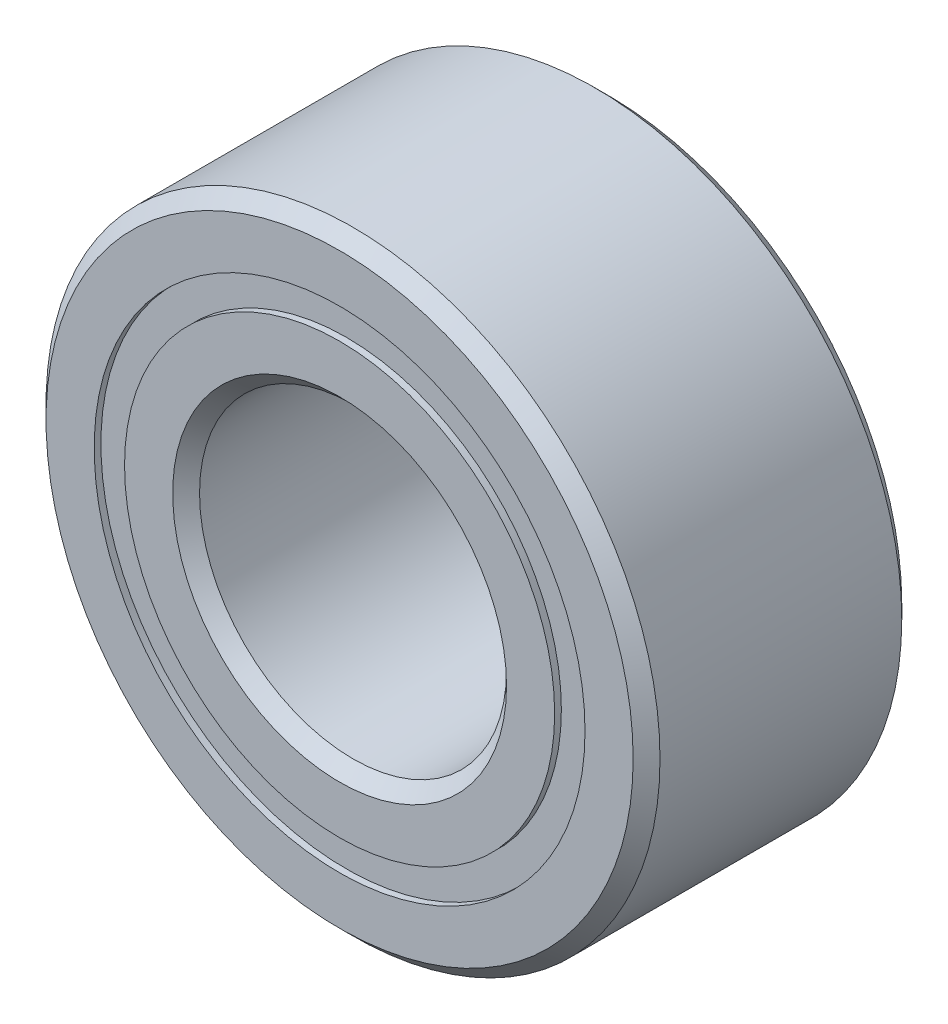
ISO-10303-21;
HEADER;
FILE_DESCRIPTION(('STEP AP214'),'2;1');
FILE_NAME('part.step','',(''),(''),'','','');
FILE_SCHEMA(('AUTOMOTIVE_DESIGN { 1 0 10303 214 1 1 1 1 }'));
ENDSEC;
DATA;
#1=APPLICATION_CONTEXT('core data for automotive mechanical design processes');
#2=APPLICATION_PROTOCOL_DEFINITION('international standard','automotive_design',2000,#1);
#3=PRODUCT_CONTEXT('',#1,'mechanical');
#4=PRODUCT('Part','Part','',(#3));
#5=PRODUCT_RELATED_PRODUCT_CATEGORY('part','',(#4));
#6=PRODUCT_DEFINITION_FORMATION('','',#4);
#7=PRODUCT_DEFINITION_CONTEXT('part definition',#1,'design');
#8=PRODUCT_DEFINITION('design','',#6,#7);
#9=PRODUCT_DEFINITION_SHAPE('','',#8);
#10=(LENGTH_UNIT() NAMED_UNIT(*) SI_UNIT(.MILLI.,.METRE.));
#11=(NAMED_UNIT(*) PLANE_ANGLE_UNIT() SI_UNIT($,.RADIAN.));
#12=(NAMED_UNIT(*) SI_UNIT($,.STERADIAN.) SOLID_ANGLE_UNIT());
#13=UNCERTAINTY_MEASURE_WITH_UNIT(LENGTH_MEASURE(1.E-05),#10,'distance_accuracy_value','');
#14=(GEOMETRIC_REPRESENTATION_CONTEXT(3) GLOBAL_UNCERTAINTY_ASSIGNED_CONTEXT((#13)) GLOBAL_UNIT_ASSIGNED_CONTEXT((#10,
#11,#12)) REPRESENTATION_CONTEXT('',''));
#15=CARTESIAN_POINT('',(0.,0.,0.));
#16=DIRECTION('',(0.,0.,1.));
#17=DIRECTION('',(1.,0.,0.));
#18=AXIS2_PLACEMENT_3D('',#15,#16,#17);
#19=CARTESIAN_POINT('',(0.,2.53825549450549,-1.319609375));
#20=DIRECTION('',(0.,0.,1.));
#21=DIRECTION('',(1.,0.,0.));
#22=AXIS2_PLACEMENT_3D('',#19,#20,#21);
#23=PLANE('',#22);
#24=CARTESIAN_POINT('',(0.,0.,-1.319609375));
#25=DIRECTION('',(0.,0.,1.));
#26=DIRECTION('',(1.,0.,0.));
#27=AXIS2_PLACEMENT_3D('',#24,#25,#26);
#28=CIRCLE('',#27,2.53825549450549);
#29=CARTESIAN_POINT('',(2.53825549450549,0.,-1.319609375));
#30=VERTEX_POINT('',#29);
#31=EDGE_CURVE('E60',#30,#30,#28,.T.);
#32=ORIENTED_EDGE('',*,*,#31,.F.);
#33=EDGE_LOOP('',(#32));
#34=FACE_BOUND('',#33,.T.);
#35=CARTESIAN_POINT('',(0.,0.,-1.319609375));
#36=DIRECTION('',(0.,0.,1.));
#37=DIRECTION('',(1.,0.,0.));
#38=AXIS2_PLACEMENT_3D('',#35,#36,#37);
#39=CIRCLE('',#38,2.22424450549451);
#40=CARTESIAN_POINT('',(2.22424450549451,0.,-1.319609375));
#41=VERTEX_POINT('',#40);
#42=EDGE_CURVE('E11',#41,#41,#39,.T.);
#43=ORIENTED_EDGE('',*,*,#42,.T.);
#44=EDGE_LOOP('',(#43));
#45=FACE_BOUND('',#44,.T.);
#46=ADVANCED_FACE('F46',(#34,#45),#23,.F.);
#47=CARTESIAN_POINT('',(0.,0.,1.3890625));
#48=DIRECTION('',(0.,0.,1.));
#49=DIRECTION('',(1.,0.,0.));
#50=AXIS2_PLACEMENT_3D('',#47,#48,#49);
#51=CYLINDRICAL_SURFACE('',#50,2.22424450549451);
#52=ORIENTED_EDGE('',*,*,#42,.F.);
#53=EDGE_LOOP('',(#52));
#54=FACE_BOUND('',#53,.T.);
#55=CARTESIAN_POINT('',(0.,0.,-0.637012925157144));
#56=DIRECTION('',(0.,0.,1.));
#57=DIRECTION('',(1.,0.,0.));
#58=AXIS2_PLACEMENT_3D('',#55,#56,#57);
#59=CIRCLE('',#58,2.22424450549451);
#60=CARTESIAN_POINT('',(2.22424450549451,0.,-0.637012925157144));
#61=VERTEX_POINT('',#60);
#62=EDGE_CURVE('E52',#61,#61,#59,.T.);
#63=ORIENTED_EDGE('',*,*,#62,.T.);
#64=EDGE_LOOP('',(#63));
#65=FACE_BOUND('',#64,.T.);
#66=ADVANCED_FACE('F69',(#54,#65),#51,.F.);
#67=CARTESIAN_POINT('',(0.,2.53825549450549,-0.637012925157144));
#68=DIRECTION('',(0.,0.,-1.));
#69=DIRECTION('',(-1.,0.,0.));
#70=AXIS2_PLACEMENT_3D('',#67,#68,#69);
#71=PLANE('',#70);
#72=ORIENTED_EDGE('',*,*,#62,.F.);
#73=EDGE_LOOP('',(#72));
#74=FACE_BOUND('',#73,.T.);
#75=CARTESIAN_POINT('',(0.,0.,-0.637012925157144));
#76=DIRECTION('',(0.,0.,1.));
#77=DIRECTION('',(1.,0.,0.));
#78=AXIS2_PLACEMENT_3D('',#75,#76,#77);
#79=CIRCLE('',#78,2.53825549450549);
#80=CARTESIAN_POINT('',(2.53825549450549,0.,-0.637012925157144));
#81=VERTEX_POINT('',#80);
#82=EDGE_CURVE('E56',#81,#81,#79,.T.);
#83=ORIENTED_EDGE('',*,*,#82,.T.);
#84=EDGE_LOOP('',(#83));
#85=FACE_BOUND('',#84,.T.);
#86=ADVANCED_FACE('F73',(#74,#85),#71,.F.);
#87=CARTESIAN_POINT('',(0.,0.,1.3890625));
#88=DIRECTION('',(0.,0.,1.));
#89=DIRECTION('',(1.,0.,0.));
#90=AXIS2_PLACEMENT_3D('',#87,#88,#89);
#91=CYLINDRICAL_SURFACE('',#90,2.53825549450549);
#92=ORIENTED_EDGE('',*,*,#82,.F.);
#93=EDGE_LOOP('',(#92));
#94=FACE_BOUND('',#93,.T.);
#95=ORIENTED_EDGE('',*,*,#31,.T.);
#96=EDGE_LOOP('',(#95));
#97=FACE_BOUND('',#96,.T.);
#98=ADVANCED_FACE('F66',(#94,#97),#91,.T.);
#99=CLOSED_SHELL('',(#46,#66,#86,#98));
#100=MANIFOLD_SOLID_BREP('B2',#99);
#101=CARTESIAN_POINT('',(0.,2.53825549450549,1.319609375));
#102=DIRECTION('',(0.,0.,-1.));
#103=DIRECTION('',(-1.,0.,0.));
#104=AXIS2_PLACEMENT_3D('',#101,#102,#103);
#105=PLANE('',#104);
#106=CARTESIAN_POINT('',(0.,0.,1.319609375));
#107=DIRECTION('',(0.,0.,1.));
#108=DIRECTION('',(1.,0.,0.));
#109=AXIS2_PLACEMENT_3D('',#106,#107,#108);
#110=CIRCLE('',#109,2.2242445054945);
#111=CARTESIAN_POINT('',(2.2242445054945,0.,1.319609375));
#112=VERTEX_POINT('',#111);
#113=EDGE_CURVE('E45',#112,#112,#110,.T.);
#114=ORIENTED_EDGE('',*,*,#113,.F.);
#115=EDGE_LOOP('',(#114));
#116=FACE_BOUND('',#115,.T.);
#117=CARTESIAN_POINT('',(0.,0.,1.319609375));
#118=DIRECTION('',(0.,0.,1.));
#119=DIRECTION('',(1.,0.,0.));
#120=AXIS2_PLACEMENT_3D('',#117,#118,#119);
#121=CIRCLE('',#120,2.53825549450549);
#122=CARTESIAN_POINT('',(2.53825549450549,0.,1.319609375));
#123=VERTEX_POINT('',#122);
#124=EDGE_CURVE('E128',#123,#123,#121,.T.);
#125=ORIENTED_EDGE('',*,*,#124,.T.);
#126=EDGE_LOOP('',(#125));
#127=FACE_BOUND('',#126,.T.);
#128=ADVANCED_FACE('F114',(#116,#127),#105,.F.);
#129=CARTESIAN_POINT('',(0.,0.,1.3890625));
#130=DIRECTION('',(0.,0.,1.));
#131=DIRECTION('',(1.,0.,0.));
#132=AXIS2_PLACEMENT_3D('',#129,#130,#131);
#133=CYLINDRICAL_SURFACE('',#132,2.2242445054945);
#134=CARTESIAN_POINT('',(0.,0.,0.637012925157143));
#135=DIRECTION('',(0.,0.,1.));
#136=DIRECTION('',(1.,0.,0.));
#137=AXIS2_PLACEMENT_3D('',#134,#135,#136);
#138=CIRCLE('',#137,2.2242445054945);
#139=CARTESIAN_POINT('',(2.2242445054945,0.,0.637012925157143));
#140=VERTEX_POINT('',#139);
#141=EDGE_CURVE('E120',#140,#140,#138,.T.);
#142=ORIENTED_EDGE('',*,*,#141,.F.);
#143=EDGE_LOOP('',(#142));
#144=FACE_BOUND('',#143,.T.);
#145=ORIENTED_EDGE('',*,*,#113,.T.);
#146=EDGE_LOOP('',(#145));
#147=FACE_BOUND('',#146,.T.);
#148=ADVANCED_FACE('F143',(#144,#147),#133,.F.);
#149=CARTESIAN_POINT('',(0.,2.53825549450549,0.637012925157143));
#150=DIRECTION('',(0.,0.,1.));
#151=DIRECTION('',(1.,0.,0.));
#152=AXIS2_PLACEMENT_3D('',#149,#150,#151);
#153=PLANE('',#152);
#154=CARTESIAN_POINT('',(0.,0.,0.637012925157143));
#155=DIRECTION('',(0.,0.,1.));
#156=DIRECTION('',(1.,0.,0.));
#157=AXIS2_PLACEMENT_3D('',#154,#155,#156);
#158=CIRCLE('',#157,2.53825549450549);
#159=CARTESIAN_POINT('',(2.53825549450549,0.,0.637012925157143));
#160=VERTEX_POINT('',#159);
#161=EDGE_CURVE('E124',#160,#160,#158,.T.);
#162=ORIENTED_EDGE('',*,*,#161,.F.);
#163=EDGE_LOOP('',(#162));
#164=FACE_BOUND('',#163,.T.);
#165=ORIENTED_EDGE('',*,*,#141,.T.);
#166=EDGE_LOOP('',(#165));
#167=FACE_BOUND('',#166,.T.);
#168=ADVANCED_FACE('F138',(#164,#167),#153,.F.);
#169=CARTESIAN_POINT('',(0.,0.,1.3890625));
#170=DIRECTION('',(0.,0.,1.));
#171=DIRECTION('',(1.,0.,0.));
#172=AXIS2_PLACEMENT_3D('',#169,#170,#171);
#173=CYLINDRICAL_SURFACE('',#172,2.53825549450549);
#174=ORIENTED_EDGE('',*,*,#124,.F.);
#175=EDGE_LOOP('',(#174));
#176=FACE_BOUND('',#175,.T.);
#177=ORIENTED_EDGE('',*,*,#161,.T.);
#178=EDGE_LOOP('',(#177));
#179=FACE_BOUND('',#178,.T.);
#180=ADVANCED_FACE('F135',(#176,#179),#173,.T.);
#181=CLOSED_SHELL('',(#128,#148,#168,#180));
#182=MANIFOLD_SOLID_BREP('B6',#181);
#183=CARTESIAN_POINT('',(-1.39966363202143,1.92647171785536,0.));
#184=DIRECTION('',(0.,0.,1.));
#185=DIRECTION('',(-0.587785252292462,0.809016994374955,0.));
#186=AXIS2_PLACEMENT_3D('',#183,#184,#185);
#187=SPHERICAL_SURFACE('',#186,0.637012925157143);
#188=CARTESIAN_POINT('',(-1.39966363202143,1.92647171785536,0.637012925157143));
#189=VERTEX_POINT('',#188);
#190=VERTEX_LOOP('',#189);
#191=FACE_BOUND('',#190,.T.);
#192=ADVANCED_FACE('F182',(#191),#187,.T.);
#193=CLOSED_SHELL('',(#192));
#194=MANIFOLD_SOLID_BREP('B40',#193);
#195=CARTESIAN_POINT('',(-2.26470332942783,0.735846717855369,0.));
#196=DIRECTION('',(0.,0.,1.));
#197=DIRECTION('',(-0.95105651629515,0.309016994374958,0.));
#198=AXIS2_PLACEMENT_3D('',#195,#196,#197);
#199=SPHERICAL_SURFACE('',#198,0.637012925157143);
#200=CARTESIAN_POINT('',(-2.26470332942783,0.735846717855369,0.637012925157143));
#201=VERTEX_POINT('',#200);
#202=VERTEX_LOOP('',#201);
#203=FACE_BOUND('',#202,.T.);
#204=ADVANCED_FACE('F203',(#203),#199,.T.);
#205=CLOSED_SHELL('',(#204));
#206=MANIFOLD_SOLID_BREP('B110',#205);
#207=CARTESIAN_POINT('',(-2.26470332942784,-0.735846717855322,0.));
#208=DIRECTION('',(0.,0.,1.));
#209=DIRECTION('',(-0.951056516295157,-0.309016994374938,0.));
#210=AXIS2_PLACEMENT_3D('',#207,#208,#209);
#211=SPHERICAL_SURFACE('',#210,0.637012925157143);
#212=CARTESIAN_POINT('',(-2.26470332942784,-0.735846717855322,0.637012925157143));
#213=VERTEX_POINT('',#212);
#214=VERTEX_LOOP('',#213);
#215=FACE_BOUND('',#214,.T.);
#216=ADVANCED_FACE('F224',(#215),#211,.T.);
#217=CLOSED_SHELL('',(#216));
#218=MANIFOLD_SOLID_BREP('B178',#217);
#219=CARTESIAN_POINT('',(-1.39966363202147,-1.92647171785533,0.));
#220=DIRECTION('',(0.,0.,1.));
#221=DIRECTION('',(-0.58778525229248,-0.809016994374942,0.));
#222=AXIS2_PLACEMENT_3D('',#219,#220,#221);
#223=SPHERICAL_SURFACE('',#222,0.637012925157143);
#224=CARTESIAN_POINT('',(-1.39966363202147,-1.92647171785533,0.637012925157143));
#225=VERTEX_POINT('',#224);
#226=VERTEX_LOOP('',#225);
#227=FACE_BOUND('',#226,.T.);
#228=ADVANCED_FACE('F245',(#227),#223,.T.);
#229=CLOSED_SHELL('',(#228));
#230=MANIFOLD_SOLID_BREP('B199',#229);
#231=CARTESIAN_POINT('',(0.,-2.38125,0.));
#232=DIRECTION('',(0.,0.,1.));
#233=DIRECTION('',(0.,-1.,0.));
#234=AXIS2_PLACEMENT_3D('',#231,#232,#233);
#235=SPHERICAL_SURFACE('',#234,0.637012925157143);
#236=CARTESIAN_POINT('',(0.,-2.38125,0.637012925157143));
#237=VERTEX_POINT('',#236);
#238=VERTEX_LOOP('',#237);
#239=FACE_BOUND('',#238,.T.);
#240=ADVANCED_FACE('F266',(#239),#235,.T.);
#241=CLOSED_SHELL('',(#240));
#242=MANIFOLD_SOLID_BREP('B220',#241);
#243=CARTESIAN_POINT('',(1.39966363202144,-1.92647171785535,0.));
#244=DIRECTION('',(0.,0.,1.));
#245=DIRECTION('',(0.587785252292469,-0.809016994374951,0.));
#246=AXIS2_PLACEMENT_3D('',#243,#244,#245);
#247=SPHERICAL_SURFACE('',#246,0.637012925157143);
#248=CARTESIAN_POINT('',(1.39966363202144,-1.92647171785535,0.637012925157143));
#249=VERTEX_POINT('',#248);
#250=VERTEX_LOOP('',#249);
#251=FACE_BOUND('',#250,.T.);
#252=ADVANCED_FACE('F287',(#251),#247,.T.);
#253=CLOSED_SHELL('',(#252));
#254=MANIFOLD_SOLID_BREP('B241',#253);
#255=CARTESIAN_POINT('',(2.26470332942783,-0.735846717855353,0.));
#256=DIRECTION('',(0.,0.,1.));
#257=DIRECTION('',(0.951056516295152,-0.309016994374952,0.));
#258=AXIS2_PLACEMENT_3D('',#255,#256,#257);
#259=SPHERICAL_SURFACE('',#258,0.637012925157143);
#260=CARTESIAN_POINT('',(2.26470332942783,-0.735846717855353,0.637012925157143));
#261=VERTEX_POINT('',#260);
#262=VERTEX_LOOP('',#261);
#263=FACE_BOUND('',#262,.T.);
#264=ADVANCED_FACE('F308',(#263),#259,.T.);
#265=CLOSED_SHELL('',(#264));
#266=MANIFOLD_SOLID_BREP('B262',#265);
#267=CARTESIAN_POINT('',(2.26470332942784,0.735846717855337,0.));
#268=DIRECTION('',(0.,0.,1.));
#269=DIRECTION('',(0.951056516295155,0.309016994374945,0.));
#270=AXIS2_PLACEMENT_3D('',#267,#268,#269);
#271=SPHERICAL_SURFACE('',#270,0.637012925157143);
#272=CARTESIAN_POINT('',(2.26470332942784,0.735846717855337,0.637012925157143));
#273=VERTEX_POINT('',#272);
#274=VERTEX_LOOP('',#273);
#275=FACE_BOUND('',#274,.T.);
#276=ADVANCED_FACE('F329',(#275),#271,.T.);
#277=CLOSED_SHELL('',(#276));
#278=MANIFOLD_SOLID_BREP('B283',#277);
#279=CARTESIAN_POINT('',(1.39966363202145,1.92647171785534,0.));
#280=DIRECTION('',(0.,0.,1.));
#281=DIRECTION('',(0.587785252292474,0.809016994374947,0.));
#282=AXIS2_PLACEMENT_3D('',#279,#280,#281);
#283=SPHERICAL_SURFACE('',#282,0.637012925157143);
#284=CARTESIAN_POINT('',(1.39966363202145,1.92647171785534,0.637012925157143));
#285=VERTEX_POINT('',#284);
#286=VERTEX_LOOP('',#285);
#287=FACE_BOUND('',#286,.T.);
#288=ADVANCED_FACE('F350',(#287),#283,.T.);
#289=CLOSED_SHELL('',(#288));
#290=MANIFOLD_SOLID_BREP('B304',#289);
#291=CARTESIAN_POINT('',(0.,2.38125,0.));
#292=DIRECTION('',(0.,0.,1.));
#293=DIRECTION('',(0.,1.,0.));
#294=AXIS2_PLACEMENT_3D('',#291,#292,#293);
#295=SPHERICAL_SURFACE('',#294,0.637012925157143);
#296=CARTESIAN_POINT('',(0.,2.38125,0.637012925157143));
#297=VERTEX_POINT('',#296);
#298=VERTEX_LOOP('',#297);
#299=FACE_BOUND('',#298,.T.);
#300=ADVANCED_FACE('F373',(#299),#295,.T.);
#301=CLOSED_SHELL('',(#300));
#302=MANIFOLD_SOLID_BREP('B325',#301);
#303=CARTESIAN_POINT('',(0.,2.22424450549451,1.3890625));
#304=DIRECTION('',(0.,0.,-1.));
#305=DIRECTION('',(-1.,0.,0.));
#306=AXIS2_PLACEMENT_3D('',#303,#304,#305);
#307=PLANE('',#306);
#308=CARTESIAN_POINT('',(0.,0.,1.3890625));
#309=DIRECTION('',(0.,0.,1.));
#310=DIRECTION('',(1.,0.,0.));
#311=AXIS2_PLACEMENT_3D('',#308,#309,#310);
#312=CIRCLE('',#311,1.72640625);
#313=CARTESIAN_POINT('',(1.72640625,0.,1.3890625));
#314=VERTEX_POINT('',#313);
#315=EDGE_CURVE('E421',#314,#314,#312,.T.);
#316=ORIENTED_EDGE('',*,*,#315,.F.);
#317=EDGE_LOOP('',(#316));
#318=FACE_BOUND('',#317,.T.);
#319=CARTESIAN_POINT('',(0.,0.,1.3890625));
#320=DIRECTION('',(0.,0.,1.));
#321=DIRECTION('',(1.,0.,0.));
#322=AXIS2_PLACEMENT_3D('',#319,#320,#321);
#323=CIRCLE('',#322,2.22424450549451);
#324=CARTESIAN_POINT('',(2.22424450549451,0.,1.3890625));
#325=VERTEX_POINT('',#324);
#326=EDGE_CURVE('E372',#325,#325,#323,.T.);
#327=ORIENTED_EDGE('',*,*,#326,.T.);
#328=EDGE_LOOP('',(#327));
#329=FACE_BOUND('',#328,.T.);
#330=ADVANCED_FACE('F393',(#318,#329),#307,.F.);
#331=CARTESIAN_POINT('',(0.,0.,1.3890625));
#332=DIRECTION('',(0.,0.,1.));
#333=DIRECTION('',(1.,0.,0.));
#334=AXIS2_PLACEMENT_3D('',#331,#332,#333);
#335=CYLINDRICAL_SURFACE('',#334,2.22424450549451);
#336=ORIENTED_EDGE('',*,*,#326,.F.);
#337=EDGE_LOOP('',(#336));
#338=FACE_BOUND('',#337,.T.);
#339=CARTESIAN_POINT('',(0.,0.,0.617361111111111));
#340=DIRECTION('',(0.,0.,1.));
#341=DIRECTION('',(1.,0.,0.));
#342=AXIS2_PLACEMENT_3D('',#339,#340,#341);
#343=CIRCLE('',#342,2.2242445054945);
#344=CARTESIAN_POINT('',(2.2242445054945,0.,0.617361111111111));
#345=VERTEX_POINT('',#344);
#346=EDGE_CURVE('E399',#345,#345,#343,.T.);
#347=ORIENTED_EDGE('',*,*,#346,.T.);
#348=EDGE_LOOP('',(#347));
#349=FACE_BOUND('',#348,.T.);
#350=ADVANCED_FACE('F428',(#338,#349),#335,.T.);
#351=CARTESIAN_POINT('',(0.,0.,0.));
#352=DIRECTION('',(0.,0.,1.));
#353=DIRECTION('',(1.,0.,0.));
#354=AXIS2_PLACEMENT_3D('',#351,#352,#353);
#355=TOROIDAL_SURFACE('',#354,2.38124999999999,0.637012925157142);
#356=ORIENTED_EDGE('',*,*,#346,.F.);
#357=EDGE_LOOP('',(#356));
#358=FACE_BOUND('',#357,.T.);
#359=CARTESIAN_POINT('',(0.,0.,-0.617361111111113));
#360=DIRECTION('',(0.,0.,1.));
#361=DIRECTION('',(1.,0.,0.));
#362=AXIS2_PLACEMENT_3D('',#359,#360,#361);
#363=CIRCLE('',#362,2.2242445054945);
#364=CARTESIAN_POINT('',(2.2242445054945,0.,-0.617361111111113));
#365=VERTEX_POINT('',#364);
#366=EDGE_CURVE('E403',#365,#365,#363,.T.);
#367=ORIENTED_EDGE('',*,*,#366,.T.);
#368=EDGE_LOOP('',(#367));
#369=FACE_BOUND('',#368,.T.);
#370=ADVANCED_FACE('F432',(#358,#369),#355,.F.);
#371=CARTESIAN_POINT('',(0.,0.,1.3890625));
#372=DIRECTION('',(0.,0.,1.));
#373=DIRECTION('',(1.,0.,0.));
#374=AXIS2_PLACEMENT_3D('',#371,#372,#373);
#375=CYLINDRICAL_SURFACE('',#374,2.22424450549451);
#376=ORIENTED_EDGE('',*,*,#366,.F.);
#377=EDGE_LOOP('',(#376));
#378=FACE_BOUND('',#377,.T.);
#379=CARTESIAN_POINT('',(0.,0.,-1.3890625));
#380=DIRECTION('',(0.,0.,1.));
#381=DIRECTION('',(1.,0.,0.));
#382=AXIS2_PLACEMENT_3D('',#379,#380,#381);
#383=CIRCLE('',#382,2.22424450549451);
#384=CARTESIAN_POINT('',(2.22424450549451,0.,-1.3890625));
#385=VERTEX_POINT('',#384);
#386=EDGE_CURVE('E407',#385,#385,#383,.T.);
#387=ORIENTED_EDGE('',*,*,#386,.T.);
#388=EDGE_LOOP('',(#387));
#389=FACE_BOUND('',#388,.T.);
#390=ADVANCED_FACE('F437',(#378,#389),#375,.T.);
#391=CARTESIAN_POINT('',(0.,1.72640625,-1.3890625));
#392=DIRECTION('',(0.,0.,1.));
#393=DIRECTION('',(1.,0.,0.));
#394=AXIS2_PLACEMENT_3D('',#391,#392,#393);
#395=PLANE('',#394);
#396=ORIENTED_EDGE('',*,*,#386,.F.);
#397=EDGE_LOOP('',(#396));
#398=FACE_BOUND('',#397,.T.);
#399=CARTESIAN_POINT('',(0.,0.,-1.3890625));
#400=DIRECTION('',(0.,0.,1.));
#401=DIRECTION('',(1.,0.,0.));
#402=AXIS2_PLACEMENT_3D('',#399,#400,#401);
#403=CIRCLE('',#402,1.72640625);
#404=CARTESIAN_POINT('',(1.72640625,0.,-1.3890625));
#405=VERTEX_POINT('',#404);
#406=EDGE_CURVE('E412',#405,#405,#403,.T.);
#407=ORIENTED_EDGE('',*,*,#406,.T.);
#408=EDGE_LOOP('',(#407));
#409=FACE_BOUND('',#408,.T.);
#410=ADVANCED_FACE('F443',(#398,#409),#395,.F.);
#411=CARTESIAN_POINT('',(0.,0.,-1.25015625));
#412=DIRECTION('',(0.,0.,-1.));
#413=DIRECTION('',(-1.,0.,0.));
#414=AXIS2_PLACEMENT_3D('',#411,#412,#413);
#415=CONICAL_SURFACE('',#414,1.5875,0.785398163397452);
#416=ORIENTED_EDGE('',*,*,#406,.F.);
#417=EDGE_LOOP('',(#416));
#418=FACE_BOUND('',#417,.T.);
#419=CARTESIAN_POINT('',(0.,0.,-1.25015625));
#420=DIRECTION('',(0.,0.,1.));
#421=DIRECTION('',(1.,0.,0.));
#422=AXIS2_PLACEMENT_3D('',#419,#420,#421);
#423=CIRCLE('',#422,1.5875);
#424=CARTESIAN_POINT('',(1.5875,0.,-1.25015625));
#425=VERTEX_POINT('',#424);
#426=EDGE_CURVE('E415',#425,#425,#423,.T.);
#427=ORIENTED_EDGE('',*,*,#426,.T.);
#428=EDGE_LOOP('',(#427));
#429=FACE_BOUND('',#428,.T.);
#430=ADVANCED_FACE('F447',(#418,#429),#415,.F.);
#431=CARTESIAN_POINT('',(0.,0.,1.3890625));
#432=DIRECTION('',(0.,0.,1.));
#433=DIRECTION('',(1.,0.,0.));
#434=AXIS2_PLACEMENT_3D('',#431,#432,#433);
#435=CYLINDRICAL_SURFACE('',#434,1.5875);
#436=ORIENTED_EDGE('',*,*,#426,.F.);
#437=EDGE_LOOP('',(#436));
#438=FACE_BOUND('',#437,.T.);
#439=CARTESIAN_POINT('',(0.,0.,1.25015625));
#440=DIRECTION('',(0.,0.,1.));
#441=DIRECTION('',(1.,0.,0.));
#442=AXIS2_PLACEMENT_3D('',#439,#440,#441);
#443=CIRCLE('',#442,1.5875);
#444=CARTESIAN_POINT('',(1.5875,0.,1.25015625));
#445=VERTEX_POINT('',#444);
#446=EDGE_CURVE('E418',#445,#445,#443,.T.);
#447=ORIENTED_EDGE('',*,*,#446,.T.);
#448=EDGE_LOOP('',(#447));
#449=FACE_BOUND('',#448,.T.);
#450=ADVANCED_FACE('F451',(#438,#449),#435,.F.);
#451=CARTESIAN_POINT('',(0.,0.,1.3890625));
#452=DIRECTION('',(0.,0.,1.));
#453=DIRECTION('',(1.,0.,0.));
#454=AXIS2_PLACEMENT_3D('',#451,#452,#453);
#455=CONICAL_SURFACE('',#454,1.72640625,0.785398163397442);
#456=ORIENTED_EDGE('',*,*,#446,.F.);
#457=EDGE_LOOP('',(#456));
#458=FACE_BOUND('',#457,.T.);
#459=ORIENTED_EDGE('',*,*,#315,.T.);
#460=EDGE_LOOP('',(#459));
#461=FACE_BOUND('',#460,.T.);
#462=ADVANCED_FACE('F425',(#458,#461),#455,.F.);
#463=CLOSED_SHELL('',(#330,#350,#370,#390,#410,#430,#450,#462));
#464=MANIFOLD_SOLID_BREP('B346',#463);
#465=CARTESIAN_POINT('',(0.,0.,1.25015625));
#466=DIRECTION('',(0.,0.,-1.));
#467=DIRECTION('',(-1.,0.,0.));
#468=AXIS2_PLACEMENT_3D('',#465,#466,#467);
#469=CONICAL_SURFACE('',#468,3.175,0.785398163397446);
#470=CARTESIAN_POINT('',(0.,0.,1.3890625));
#471=DIRECTION('',(0.,0.,1.));
#472=DIRECTION('',(1.,0.,0.));
#473=AXIS2_PLACEMENT_3D('',#470,#471,#472);
#474=CIRCLE('',#473,3.03609375);
#475=CARTESIAN_POINT('',(3.03609375,0.,1.3890625));
#476=VERTEX_POINT('',#475);
#477=EDGE_CURVE('E543',#476,#476,#474,.T.);
#478=ORIENTED_EDGE('',*,*,#477,.F.);
#479=EDGE_LOOP('',(#478));
#480=FACE_BOUND('',#479,.T.);
#481=CARTESIAN_POINT('',(0.,0.,1.25015625));
#482=DIRECTION('',(0.,0.,1.));
#483=DIRECTION('',(1.,0.,0.));
#484=AXIS2_PLACEMENT_3D('',#481,#482,#483);
#485=CIRCLE('',#484,3.175);
#486=CARTESIAN_POINT('',(3.175,0.,1.25015625));
#487=VERTEX_POINT('',#486);
#488=EDGE_CURVE('E392',#487,#487,#485,.T.);
#489=ORIENTED_EDGE('',*,*,#488,.T.);
#490=EDGE_LOOP('',(#489));
#491=FACE_BOUND('',#490,.T.);
#492=ADVANCED_FACE('F515',(#480,#491),#469,.T.);
#493=CARTESIAN_POINT('',(0.,0.,1.3890625));
#494=DIRECTION('',(0.,0.,1.));
#495=DIRECTION('',(1.,0.,0.));
#496=AXIS2_PLACEMENT_3D('',#493,#494,#495);
#497=CYLINDRICAL_SURFACE('',#496,3.175);
#498=ORIENTED_EDGE('',*,*,#488,.F.);
#499=EDGE_LOOP('',(#498));
#500=FACE_BOUND('',#499,.T.);
#501=CARTESIAN_POINT('',(0.,0.,-1.25015625));
#502=DIRECTION('',(0.,0.,1.));
#503=DIRECTION('',(1.,0.,0.));
#504=AXIS2_PLACEMENT_3D('',#501,#502,#503);
#505=CIRCLE('',#504,3.175);
#506=CARTESIAN_POINT('',(3.175,0.,-1.25015625));
#507=VERTEX_POINT('',#506);
#508=EDGE_CURVE('E521',#507,#507,#505,.T.);
#509=ORIENTED_EDGE('',*,*,#508,.T.);
#510=EDGE_LOOP('',(#509));
#511=FACE_BOUND('',#510,.T.);
#512=ADVANCED_FACE('F550',(#500,#511),#497,.T.);
#513=CARTESIAN_POINT('',(0.,0.,-1.3890625));
#514=DIRECTION('',(0.,0.,1.));
#515=DIRECTION('',(1.,0.,0.));
#516=AXIS2_PLACEMENT_3D('',#513,#514,#515);
#517=CONICAL_SURFACE('',#516,3.03609375,0.785398163397445);
#518=ORIENTED_EDGE('',*,*,#508,.F.);
#519=EDGE_LOOP('',(#518));
#520=FACE_BOUND('',#519,.T.);
#521=CARTESIAN_POINT('',(0.,0.,-1.3890625));
#522=DIRECTION('',(0.,0.,1.));
#523=DIRECTION('',(1.,0.,0.));
#524=AXIS2_PLACEMENT_3D('',#521,#522,#523);
#525=CIRCLE('',#524,3.03609375);
#526=CARTESIAN_POINT('',(3.03609375,0.,-1.3890625));
#527=VERTEX_POINT('',#526);
#528=EDGE_CURVE('E525',#527,#527,#525,.T.);
#529=ORIENTED_EDGE('',*,*,#528,.T.);
#530=EDGE_LOOP('',(#529));
#531=FACE_BOUND('',#530,.T.);
#532=ADVANCED_FACE('F554',(#520,#531),#517,.T.);
#533=CARTESIAN_POINT('',(0.,3.03609375,-1.3890625));
#534=DIRECTION('',(0.,0.,1.));
#535=DIRECTION('',(1.,0.,0.));
#536=AXIS2_PLACEMENT_3D('',#533,#534,#535);
#537=PLANE('',#536);
#538=ORIENTED_EDGE('',*,*,#528,.F.);
#539=EDGE_LOOP('',(#538));
#540=FACE_BOUND('',#539,.T.);
#541=CARTESIAN_POINT('',(0.,0.,-1.3890625));
#542=DIRECTION('',(0.,0.,1.));
#543=DIRECTION('',(1.,0.,0.));
#544=AXIS2_PLACEMENT_3D('',#541,#542,#543);
#545=CIRCLE('',#544,2.53825549450549);
#546=CARTESIAN_POINT('',(2.53825549450549,0.,-1.3890625));
#547=VERTEX_POINT('',#546);
#548=EDGE_CURVE('E529',#547,#547,#545,.T.);
#549=ORIENTED_EDGE('',*,*,#548,.T.);
#550=EDGE_LOOP('',(#549));
#551=FACE_BOUND('',#550,.T.);
#552=ADVANCED_FACE('F559',(#540,#551),#537,.F.);
#553=CARTESIAN_POINT('',(0.,0.,1.3890625));
#554=DIRECTION('',(0.,0.,1.));
#555=DIRECTION('',(1.,0.,0.));
#556=AXIS2_PLACEMENT_3D('',#553,#554,#555);
#557=CYLINDRICAL_SURFACE('',#556,2.53825549450549);
#558=ORIENTED_EDGE('',*,*,#548,.F.);
#559=EDGE_LOOP('',(#558));
#560=FACE_BOUND('',#559,.T.);
#561=CARTESIAN_POINT('',(0.,0.,-0.617361111111112));
#562=DIRECTION('',(0.,0.,1.));
#563=DIRECTION('',(1.,0.,0.));
#564=AXIS2_PLACEMENT_3D('',#561,#562,#563);
#565=CIRCLE('',#564,2.53825549450549);
#566=CARTESIAN_POINT('',(2.53825549450549,0.,-0.617361111111112));
#567=VERTEX_POINT('',#566);
#568=EDGE_CURVE('E534',#567,#567,#565,.T.);
#569=ORIENTED_EDGE('',*,*,#568,.T.);
#570=EDGE_LOOP('',(#569));
#571=FACE_BOUND('',#570,.T.);
#572=ADVANCED_FACE('F565',(#560,#571),#557,.F.);
#573=CARTESIAN_POINT('',(0.,0.,0.));
#574=DIRECTION('',(0.,0.,1.));
#575=DIRECTION('',(1.,0.,0.));
#576=AXIS2_PLACEMENT_3D('',#573,#574,#575);
#577=TOROIDAL_SURFACE('',#576,2.38125,0.637012925157143);
#578=ORIENTED_EDGE('',*,*,#568,.F.);
#579=EDGE_LOOP('',(#578));
#580=FACE_BOUND('',#579,.T.);
#581=CARTESIAN_POINT('',(0.,0.,0.617361111111111));
#582=DIRECTION('',(0.,0.,1.));
#583=DIRECTION('',(1.,0.,0.));
#584=AXIS2_PLACEMENT_3D('',#581,#582,#583);
#585=CIRCLE('',#584,2.53825549450549);
#586=CARTESIAN_POINT('',(2.53825549450549,0.,0.617361111111111));
#587=VERTEX_POINT('',#586);
#588=EDGE_CURVE('E537',#587,#587,#585,.T.);
#589=ORIENTED_EDGE('',*,*,#588,.T.);
#590=EDGE_LOOP('',(#589));
#591=FACE_BOUND('',#590,.T.);
#592=ADVANCED_FACE('F569',(#580,#591),#577,.F.);
#593=CARTESIAN_POINT('',(0.,0.,1.3890625));
#594=DIRECTION('',(0.,0.,1.));
#595=DIRECTION('',(1.,0.,0.));
#596=AXIS2_PLACEMENT_3D('',#593,#594,#595);
#597=CYLINDRICAL_SURFACE('',#596,2.53825549450549);
#598=ORIENTED_EDGE('',*,*,#588,.F.);
#599=EDGE_LOOP('',(#598));
#600=FACE_BOUND('',#599,.T.);
#601=CARTESIAN_POINT('',(0.,0.,1.3890625));
#602=DIRECTION('',(0.,0.,1.));
#603=DIRECTION('',(1.,0.,0.));
#604=AXIS2_PLACEMENT_3D('',#601,#602,#603);
#605=CIRCLE('',#604,2.53825549450549);
#606=CARTESIAN_POINT('',(2.53825549450549,0.,1.3890625));
#607=VERTEX_POINT('',#606);
#608=EDGE_CURVE('E540',#607,#607,#605,.T.);
#609=ORIENTED_EDGE('',*,*,#608,.T.);
#610=EDGE_LOOP('',(#609));
#611=FACE_BOUND('',#610,.T.);
#612=ADVANCED_FACE('F573',(#600,#611),#597,.F.);
#613=CARTESIAN_POINT('',(0.,3.03609375,1.3890625));
#614=DIRECTION('',(0.,0.,-1.));
#615=DIRECTION('',(-1.,0.,0.));
#616=AXIS2_PLACEMENT_3D('',#613,#614,#615);
#617=PLANE('',#616);
#618=ORIENTED_EDGE('',*,*,#608,.F.);
#619=EDGE_LOOP('',(#618));
#620=FACE_BOUND('',#619,.T.);
#621=ORIENTED_EDGE('',*,*,#477,.T.);
#622=EDGE_LOOP('',(#621));
#623=FACE_BOUND('',#622,.T.);
#624=ADVANCED_FACE('F547',(#620,#623),#617,.F.);
#625=CLOSED_SHELL('',(#492,#512,#532,#552,#572,#592,#612,#624));
#626=MANIFOLD_SOLID_BREP('B367',#625);
#627=ADVANCED_BREP_SHAPE_REPRESENTATION('',(#18,#100,#182,#194,#206,#218,#230,#242,#254,#266,
#278,#290,#302,#464,#626),#14);
#628=SHAPE_DEFINITION_REPRESENTATION(#9,#627);
ENDSEC;
END-ISO-10303-21;
